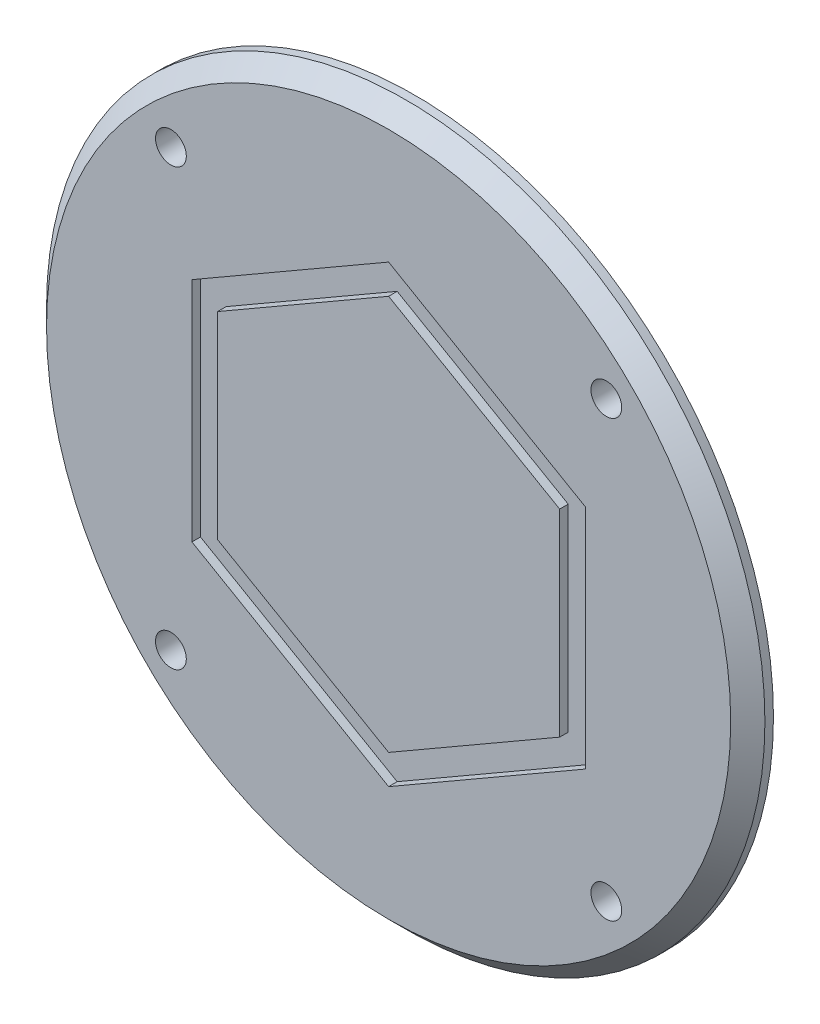
ISO-10303-21;
HEADER;
FILE_DESCRIPTION(('STEP AP214'),'2;1');
FILE_NAME('part.step','',(''),(''),'','','');
FILE_SCHEMA(('AUTOMOTIVE_DESIGN { 1 0 10303 214 1 1 1 1 }'));
ENDSEC;
DATA;
#1=APPLICATION_CONTEXT('core data for automotive mechanical design processes');
#2=APPLICATION_PROTOCOL_DEFINITION('international standard','automotive_design',2000,#1);
#3=PRODUCT_CONTEXT('',#1,'mechanical');
#4=PRODUCT('Part','Part','',(#3));
#5=PRODUCT_RELATED_PRODUCT_CATEGORY('part','',(#4));
#6=PRODUCT_DEFINITION_FORMATION('','',#4);
#7=PRODUCT_DEFINITION_CONTEXT('part definition',#1,'design');
#8=PRODUCT_DEFINITION('design','',#6,#7);
#9=PRODUCT_DEFINITION_SHAPE('','',#8);
#10=(LENGTH_UNIT() NAMED_UNIT(*) SI_UNIT(.MILLI.,.METRE.));
#11=(NAMED_UNIT(*) PLANE_ANGLE_UNIT() SI_UNIT($,.RADIAN.));
#12=(NAMED_UNIT(*) SI_UNIT($,.STERADIAN.) SOLID_ANGLE_UNIT());
#13=UNCERTAINTY_MEASURE_WITH_UNIT(LENGTH_MEASURE(1.E-05),#10,'distance_accuracy_value','');
#14=(GEOMETRIC_REPRESENTATION_CONTEXT(3) GLOBAL_UNCERTAINTY_ASSIGNED_CONTEXT((#13)) GLOBAL_UNIT_ASSIGNED_CONTEXT((#10,
#11,#12)) REPRESENTATION_CONTEXT('',''));
#15=CARTESIAN_POINT('',(0.,0.,0.));
#16=DIRECTION('',(0.,0.,1.));
#17=DIRECTION('',(1.,0.,0.));
#18=AXIS2_PLACEMENT_3D('',#15,#16,#17);
#19=CARTESIAN_POINT('',(0.,0.,116.95));
#20=DIRECTION('',(0.,0.,-1.));
#21=DIRECTION('',(-1.,0.,0.));
#22=AXIS2_PLACEMENT_3D('',#19,#20,#21);
#23=CYLINDRICAL_SURFACE('',#22,42.);
#24=CARTESIAN_POINT('',(0.,0.,114.95));
#25=DIRECTION('',(0.,0.,1.));
#26=DIRECTION('',(1.,0.,0.));
#27=AXIS2_PLACEMENT_3D('',#24,#25,#26);
#28=CIRCLE('',#27,42.);
#29=CARTESIAN_POINT('',(42.,0.,114.95));
#30=VERTEX_POINT('',#29);
#31=EDGE_CURVE('E11',#30,#30,#28,.F.);
#32=ORIENTED_EDGE('',*,*,#31,.T.);
#33=EDGE_LOOP('',(#32));
#34=FACE_BOUND('',#33,.T.);
#35=CARTESIAN_POINT('',(0.,0.,113.95));
#36=DIRECTION('',(0.,0.,1.));
#37=DIRECTION('',(1.,0.,0.));
#38=AXIS2_PLACEMENT_3D('',#35,#36,#37);
#39=CIRCLE('',#38,42.);
#40=CARTESIAN_POINT('',(42.,0.,113.95));
#41=VERTEX_POINT('',#40);
#42=EDGE_CURVE('E256',#41,#41,#39,.T.);
#43=ORIENTED_EDGE('',*,*,#42,.T.);
#44=EDGE_LOOP('',(#43));
#45=FACE_BOUND('',#44,.T.);
#46=ADVANCED_FACE('F38',(#34,#45),#23,.T.);
#47=CARTESIAN_POINT('',(0.,0.,116.95));
#48=DIRECTION('',(0.,0.,1.));
#49=DIRECTION('',(1.,0.,0.));
#50=AXIS2_PLACEMENT_3D('',#47,#48,#49);
#51=PLANE('',#50);
#52=DIRECTION('',(-0.866025403784439,0.5,0.));
#53=VECTOR('',#52,1.);
#54=CARTESIAN_POINT('',(23.,13.2790561913614,116.95));
#55=LINE('',#54,#53);
#56=CARTESIAN_POINT('',(23.,13.2790561913614,116.95));
#57=VERTEX_POINT('',#56);
#58=CARTESIAN_POINT('',(0.,26.5581123827228,116.95));
#59=VERTEX_POINT('',#58);
#60=EDGE_CURVE('E54',#57,#59,#55,.T.);
#61=ORIENTED_EDGE('',*,*,#60,.F.);
#62=DIRECTION('',(0.,1.,0.));
#63=VECTOR('',#62,1.);
#64=CARTESIAN_POINT('',(23.,-13.2790561913614,116.95));
#65=LINE('',#64,#63);
#66=CARTESIAN_POINT('',(23.,-13.2790561913614,116.95));
#67=VERTEX_POINT('',#66);
#68=EDGE_CURVE('E190',#67,#57,#65,.T.);
#69=ORIENTED_EDGE('',*,*,#68,.F.);
#70=DIRECTION('',(0.866025403784439,0.5,0.));
#71=VECTOR('',#70,1.);
#72=CARTESIAN_POINT('',(0.,-26.5581123827228,116.95));
#73=LINE('',#72,#71);
#74=CARTESIAN_POINT('',(0.,-26.5581123827228,116.95));
#75=VERTEX_POINT('',#74);
#76=EDGE_CURVE('E216',#75,#67,#73,.T.);
#77=ORIENTED_EDGE('',*,*,#76,.F.);
#78=DIRECTION('',(0.866025403784439,-0.5,0.));
#79=VECTOR('',#78,1.);
#80=CARTESIAN_POINT('',(-23.,-13.2790561913614,116.95));
#81=LINE('',#80,#79);
#82=CARTESIAN_POINT('',(-23.,-13.2790561913614,116.95));
#83=VERTEX_POINT('',#82);
#84=EDGE_CURVE('E213',#83,#75,#81,.T.);
#85=ORIENTED_EDGE('',*,*,#84,.F.);
#86=DIRECTION('',(0.,-1.,0.));
#87=VECTOR('',#86,1.);
#88=CARTESIAN_POINT('',(-23.,13.2790561913614,116.95));
#89=LINE('',#88,#87);
#90=CARTESIAN_POINT('',(-23.,13.2790561913614,116.95));
#91=VERTEX_POINT('',#90);
#92=EDGE_CURVE('E210',#91,#83,#89,.T.);
#93=ORIENTED_EDGE('',*,*,#92,.F.);
#94=DIRECTION('',(-0.866025403784439,-0.5,0.));
#95=VECTOR('',#94,1.);
#96=CARTESIAN_POINT('',(0.,26.5581123827228,116.95));
#97=LINE('',#96,#95);
#98=EDGE_CURVE('E207',#59,#91,#97,.T.);
#99=ORIENTED_EDGE('',*,*,#98,.F.);
#100=EDGE_LOOP('',(#61,#69,#77,#85,#93,#99));
#101=FACE_BOUND('',#100,.T.);
#102=CARTESIAN_POINT('',(0.,0.,116.95));
#103=DIRECTION('',(0.,0.,1.));
#104=DIRECTION('',(1.,0.,0.));
#105=AXIS2_PLACEMENT_3D('',#102,#103,#104);
#106=CIRCLE('',#105,40.);
#107=CARTESIAN_POINT('',(40.,0.,116.95));
#108=VERTEX_POINT('',#107);
#109=EDGE_CURVE('E47',#108,#108,#106,.T.);
#110=ORIENTED_EDGE('',*,*,#109,.T.);
#111=EDGE_LOOP('',(#110));
#112=FACE_BOUND('',#111,.T.);
#113=CARTESIAN_POINT('',(-25.4558441227155,25.4558441227159,116.95));
#114=DIRECTION('',(0.,0.,1.));
#115=DIRECTION('',(0.,-1.,0.));
#116=AXIS2_PLACEMENT_3D('',#113,#114,#115);
#117=CIRCLE('',#116,1.8);
#118=CARTESIAN_POINT('',(-25.4558441227155,23.6558441227159,116.95));
#119=VERTEX_POINT('',#118);
#120=EDGE_CURVE('E236',#119,#119,#117,.T.);
#121=ORIENTED_EDGE('',*,*,#120,.F.);
#122=EDGE_LOOP('',(#121));
#123=FACE_BOUND('',#122,.T.);
#124=CARTESIAN_POINT('',(25.4558441227158,25.4558441227156,116.95));
#125=DIRECTION('',(0.,0.,1.));
#126=DIRECTION('',(-1.,0.,0.));
#127=AXIS2_PLACEMENT_3D('',#124,#125,#126);
#128=CIRCLE('',#127,1.8);
#129=CARTESIAN_POINT('',(23.6558441227158,25.4558441227156,116.95));
#130=VERTEX_POINT('',#129);
#131=EDGE_CURVE('E237',#130,#130,#128,.T.);
#132=ORIENTED_EDGE('',*,*,#131,.F.);
#133=EDGE_LOOP('',(#132));
#134=FACE_BOUND('',#133,.T.);
#135=CARTESIAN_POINT('',(25.4558441227153,-25.4558441227161,116.95));
#136=DIRECTION('',(0.,0.,1.));
#137=DIRECTION('',(0.,1.,0.));
#138=AXIS2_PLACEMENT_3D('',#135,#136,#137);
#139=CIRCLE('',#138,1.8);
#140=CARTESIAN_POINT('',(25.4558441227153,-23.6558441227161,116.95));
#141=VERTEX_POINT('',#140);
#142=EDGE_CURVE('E244',#141,#141,#139,.T.);
#143=ORIENTED_EDGE('',*,*,#142,.F.);
#144=EDGE_LOOP('',(#143));
#145=FACE_BOUND('',#144,.T.);
#146=CARTESIAN_POINT('',(-25.4558441227158,-25.4558441227156,116.95));
#147=DIRECTION('',(0.,0.,1.));
#148=DIRECTION('',(1.,0.,0.));
#149=AXIS2_PLACEMENT_3D('',#146,#147,#148);
#150=CIRCLE('',#149,1.8);
#151=CARTESIAN_POINT('',(-23.6558441227158,-25.4558441227156,116.95));
#152=VERTEX_POINT('',#151);
#153=EDGE_CURVE('E240',#152,#152,#150,.T.);
#154=ORIENTED_EDGE('',*,*,#153,.F.);
#155=EDGE_LOOP('',(#154));
#156=FACE_BOUND('',#155,.T.);
#157=ADVANCED_FACE('F261',(#101,#112,#123,#134,#145,#156),#51,.T.);
#158=CARTESIAN_POINT('',(0.,0.,113.95));
#159=DIRECTION('',(0.,0.,1.));
#160=DIRECTION('',(1.,0.,0.));
#161=AXIS2_PLACEMENT_3D('',#158,#159,#160);
#162=PLANE('',#161);
#163=CARTESIAN_POINT('',(-25.4558441227155,25.4558441227159,113.95));
#164=DIRECTION('',(0.,0.,1.));
#165=DIRECTION('',(0.,-1.,0.));
#166=AXIS2_PLACEMENT_3D('',#163,#164,#165);
#167=CIRCLE('',#166,1.79999999999999);
#168=CARTESIAN_POINT('',(-25.4558441227155,23.6558441227159,113.95));
#169=VERTEX_POINT('',#168);
#170=EDGE_CURVE('E233',#169,#169,#167,.T.);
#171=ORIENTED_EDGE('',*,*,#170,.T.);
#172=EDGE_LOOP('',(#171));
#173=FACE_BOUND('',#172,.T.);
#174=CARTESIAN_POINT('',(25.4558441227158,25.4558441227156,113.95));
#175=DIRECTION('',(0.,0.,1.));
#176=DIRECTION('',(-1.,0.,0.));
#177=AXIS2_PLACEMENT_3D('',#174,#175,#176);
#178=CIRCLE('',#177,1.79999999999999);
#179=CARTESIAN_POINT('',(23.6558441227159,25.4558441227156,113.95));
#180=VERTEX_POINT('',#179);
#181=EDGE_CURVE('E241',#180,#180,#178,.T.);
#182=ORIENTED_EDGE('',*,*,#181,.T.);
#183=EDGE_LOOP('',(#182));
#184=FACE_BOUND('',#183,.T.);
#185=CARTESIAN_POINT('',(25.4558441227153,-25.4558441227161,113.95));
#186=DIRECTION('',(0.,0.,1.));
#187=DIRECTION('',(0.,1.,0.));
#188=AXIS2_PLACEMENT_3D('',#185,#186,#187);
#189=CIRCLE('',#188,1.79999999999999);
#190=CARTESIAN_POINT('',(25.4558441227153,-23.6558441227161,113.95));
#191=VERTEX_POINT('',#190);
#192=EDGE_CURVE('E223',#191,#191,#189,.T.);
#193=ORIENTED_EDGE('',*,*,#192,.T.);
#194=EDGE_LOOP('',(#193));
#195=FACE_BOUND('',#194,.T.);
#196=CARTESIAN_POINT('',(-25.4558441227158,-25.4558441227156,113.95));
#197=DIRECTION('',(0.,0.,1.));
#198=DIRECTION('',(1.,0.,0.));
#199=AXIS2_PLACEMENT_3D('',#196,#197,#198);
#200=CIRCLE('',#199,1.79999999999999);
#201=CARTESIAN_POINT('',(-23.6558441227159,-25.4558441227156,113.95));
#202=VERTEX_POINT('',#201);
#203=EDGE_CURVE('E253',#202,#202,#200,.T.);
#204=ORIENTED_EDGE('',*,*,#203,.T.);
#205=EDGE_LOOP('',(#204));
#206=FACE_BOUND('',#205,.T.);
#207=ORIENTED_EDGE('',*,*,#42,.F.);
#208=EDGE_LOOP('',(#207));
#209=FACE_BOUND('',#208,.T.);
#210=ADVANCED_FACE('F283',(#173,#184,#195,#206,#209),#162,.F.);
#211=CARTESIAN_POINT('',(-25.4558441227158,-25.4558441227156,116.95));
#212=DIRECTION('',(0.,0.,1.));
#213=DIRECTION('',(1.,0.,0.));
#214=AXIS2_PLACEMENT_3D('',#211,#212,#213);
#215=CYLINDRICAL_SURFACE('',#214,1.79999999999999);
#216=ORIENTED_EDGE('',*,*,#203,.F.);
#217=EDGE_LOOP('',(#216));
#218=FACE_BOUND('',#217,.T.);
#219=ORIENTED_EDGE('',*,*,#153,.T.);
#220=EDGE_LOOP('',(#219));
#221=FACE_BOUND('',#220,.T.);
#222=ADVANCED_FACE('F290',(#218,#221),#215,.F.);
#223=CARTESIAN_POINT('',(25.4558441227153,-25.4558441227161,116.95));
#224=DIRECTION('',(0.,0.,1.));
#225=DIRECTION('',(0.,1.,0.));
#226=AXIS2_PLACEMENT_3D('',#223,#224,#225);
#227=CYLINDRICAL_SURFACE('',#226,1.79999999999999);
#228=ORIENTED_EDGE('',*,*,#192,.F.);
#229=EDGE_LOOP('',(#228));
#230=FACE_BOUND('',#229,.T.);
#231=ORIENTED_EDGE('',*,*,#142,.T.);
#232=EDGE_LOOP('',(#231));
#233=FACE_BOUND('',#232,.T.);
#234=ADVANCED_FACE('F295',(#230,#233),#227,.F.);
#235=CARTESIAN_POINT('',(25.4558441227158,25.4558441227156,116.95));
#236=DIRECTION('',(0.,0.,1.));
#237=DIRECTION('',(-1.,0.,0.));
#238=AXIS2_PLACEMENT_3D('',#235,#236,#237);
#239=CYLINDRICAL_SURFACE('',#238,1.79999999999999);
#240=ORIENTED_EDGE('',*,*,#181,.F.);
#241=EDGE_LOOP('',(#240));
#242=FACE_BOUND('',#241,.T.);
#243=ORIENTED_EDGE('',*,*,#131,.T.);
#244=EDGE_LOOP('',(#243));
#245=FACE_BOUND('',#244,.T.);
#246=ADVANCED_FACE('F274',(#242,#245),#239,.F.);
#247=CARTESIAN_POINT('',(-25.4558441227155,25.4558441227159,116.95));
#248=DIRECTION('',(0.,0.,1.));
#249=DIRECTION('',(0.,-1.,0.));
#250=AXIS2_PLACEMENT_3D('',#247,#248,#249);
#251=CYLINDRICAL_SURFACE('',#250,1.79999999999999);
#252=ORIENTED_EDGE('',*,*,#170,.F.);
#253=EDGE_LOOP('',(#252));
#254=FACE_BOUND('',#253,.T.);
#255=ORIENTED_EDGE('',*,*,#120,.T.);
#256=EDGE_LOOP('',(#255));
#257=FACE_BOUND('',#256,.T.);
#258=ADVANCED_FACE('F266',(#254,#257),#251,.F.);
#259=CARTESIAN_POINT('',(0.,0.,116.95));
#260=DIRECTION('',(0.,0.,-1.));
#261=DIRECTION('',(-1.,0.,0.));
#262=AXIS2_PLACEMENT_3D('',#259,#260,#261);
#263=CONICAL_SURFACE('',#262,40.,0.785398163397453);
#264=ORIENTED_EDGE('',*,*,#31,.F.);
#265=EDGE_LOOP('',(#264));
#266=FACE_BOUND('',#265,.T.);
#267=ORIENTED_EDGE('',*,*,#109,.F.);
#268=EDGE_LOOP('',(#267));
#269=FACE_BOUND('',#268,.T.);
#270=ADVANCED_FACE('F41',(#266,#269),#263,.T.);
#271=CARTESIAN_POINT('',(23.,13.2790561913614,115.95));
#272=DIRECTION('',(0.5,0.866025403784439,0.));
#273=DIRECTION('',(-0.866025403784439,0.5,0.));
#274=AXIS2_PLACEMENT_3D('',#271,#272,#273);
#275=PLANE('',#274);
#276=ORIENTED_EDGE('',*,*,#60,.T.);
#277=DIRECTION('',(0.,0.,1.));
#278=VECTOR('',#277,1.);
#279=CARTESIAN_POINT('',(0.,26.5581123827228,115.95));
#280=LINE('',#279,#278);
#281=CARTESIAN_POINT('',(0.,26.5581123827228,115.95));
#282=VERTEX_POINT('',#281);
#283=EDGE_CURVE('E205',#282,#59,#280,.T.);
#284=ORIENTED_EDGE('',*,*,#283,.F.);
#285=DIRECTION('',(-0.866025403784439,0.5,0.));
#286=VECTOR('',#285,1.);
#287=CARTESIAN_POINT('',(23.,13.2790561913614,115.95));
#288=LINE('',#287,#286);
#289=CARTESIAN_POINT('',(23.,13.2790561913614,115.95));
#290=VERTEX_POINT('',#289);
#291=EDGE_CURVE('E186',#290,#282,#288,.T.);
#292=ORIENTED_EDGE('',*,*,#291,.F.);
#293=DIRECTION('',(0.,0.,1.));
#294=VECTOR('',#293,1.);
#295=CARTESIAN_POINT('',(23.,13.2790561913614,115.95));
#296=LINE('',#295,#294);
#297=EDGE_CURVE('E221',#290,#57,#296,.T.);
#298=ORIENTED_EDGE('',*,*,#297,.T.);
#299=EDGE_LOOP('',(#276,#284,#292,#298));
#300=FACE_BOUND('',#299,.T.);
#301=ADVANCED_FACE('F265',(#300),#275,.F.);
#302=CARTESIAN_POINT('',(23.,-13.2790561913614,115.95));
#303=DIRECTION('',(1.,0.,0.));
#304=DIRECTION('',(0.,1.,0.));
#305=AXIS2_PLACEMENT_3D('',#302,#303,#304);
#306=PLANE('',#305);
#307=ORIENTED_EDGE('',*,*,#68,.T.);
#308=ORIENTED_EDGE('',*,*,#297,.F.);
#309=DIRECTION('',(0.,1.,0.));
#310=VECTOR('',#309,1.);
#311=CARTESIAN_POINT('',(23.,-13.2790561913614,115.95));
#312=LINE('',#311,#310);
#313=CARTESIAN_POINT('',(23.,-13.2790561913614,115.95));
#314=VERTEX_POINT('',#313);
#315=EDGE_CURVE('E202',#314,#290,#312,.T.);
#316=ORIENTED_EDGE('',*,*,#315,.F.);
#317=DIRECTION('',(0.,0.,1.));
#318=VECTOR('',#317,1.);
#319=CARTESIAN_POINT('',(23.,-13.2790561913614,115.95));
#320=LINE('',#319,#318);
#321=EDGE_CURVE('E224',#314,#67,#320,.T.);
#322=ORIENTED_EDGE('',*,*,#321,.T.);
#323=EDGE_LOOP('',(#307,#308,#316,#322));
#324=FACE_BOUND('',#323,.T.);
#325=ADVANCED_FACE('F272',(#324),#306,.F.);
#326=CARTESIAN_POINT('',(0.,-26.5581123827228,115.95));
#327=DIRECTION('',(0.5,-0.866025403784439,0.));
#328=DIRECTION('',(0.866025403784439,0.5,0.));
#329=AXIS2_PLACEMENT_3D('',#326,#327,#328);
#330=PLANE('',#329);
#331=ORIENTED_EDGE('',*,*,#76,.T.);
#332=ORIENTED_EDGE('',*,*,#321,.F.);
#333=DIRECTION('',(0.866025403784439,0.5,0.));
#334=VECTOR('',#333,1.);
#335=CARTESIAN_POINT('',(0.,-26.5581123827228,115.95));
#336=LINE('',#335,#334);
#337=CARTESIAN_POINT('',(0.,-26.5581123827228,115.95));
#338=VERTEX_POINT('',#337);
#339=EDGE_CURVE('E199',#338,#314,#336,.T.);
#340=ORIENTED_EDGE('',*,*,#339,.F.);
#341=DIRECTION('',(0.,0.,1.));
#342=VECTOR('',#341,1.);
#343=CARTESIAN_POINT('',(0.,-26.5581123827228,115.95));
#344=LINE('',#343,#342);
#345=EDGE_CURVE('E226',#338,#75,#344,.T.);
#346=ORIENTED_EDGE('',*,*,#345,.T.);
#347=EDGE_LOOP('',(#331,#332,#340,#346));
#348=FACE_BOUND('',#347,.T.);
#349=ADVANCED_FACE('F314',(#348),#330,.F.);
#350=CARTESIAN_POINT('',(-23.,-13.2790561913614,115.95));
#351=DIRECTION('',(-0.5,-0.866025403784439,0.));
#352=DIRECTION('',(0.866025403784439,-0.5,0.));
#353=AXIS2_PLACEMENT_3D('',#350,#351,#352);
#354=PLANE('',#353);
#355=ORIENTED_EDGE('',*,*,#84,.T.);
#356=ORIENTED_EDGE('',*,*,#345,.F.);
#357=DIRECTION('',(0.866025403784439,-0.5,0.));
#358=VECTOR('',#357,1.);
#359=CARTESIAN_POINT('',(-23.,-13.2790561913614,115.95));
#360=LINE('',#359,#358);
#361=CARTESIAN_POINT('',(-23.,-13.2790561913614,115.95));
#362=VERTEX_POINT('',#361);
#363=EDGE_CURVE('E196',#362,#338,#360,.T.);
#364=ORIENTED_EDGE('',*,*,#363,.F.);
#365=DIRECTION('',(0.,0.,1.));
#366=VECTOR('',#365,1.);
#367=CARTESIAN_POINT('',(-23.,-13.2790561913614,115.95));
#368=LINE('',#367,#366);
#369=EDGE_CURVE('E228',#362,#83,#368,.T.);
#370=ORIENTED_EDGE('',*,*,#369,.T.);
#371=EDGE_LOOP('',(#355,#356,#364,#370));
#372=FACE_BOUND('',#371,.T.);
#373=ADVANCED_FACE('F310',(#372),#354,.F.);
#374=CARTESIAN_POINT('',(-23.,13.2790561913614,115.95));
#375=DIRECTION('',(-1.,0.,0.));
#376=DIRECTION('',(0.,-1.,0.));
#377=AXIS2_PLACEMENT_3D('',#374,#375,#376);
#378=PLANE('',#377);
#379=ORIENTED_EDGE('',*,*,#92,.T.);
#380=ORIENTED_EDGE('',*,*,#369,.F.);
#381=DIRECTION('',(0.,-1.,0.));
#382=VECTOR('',#381,1.);
#383=CARTESIAN_POINT('',(-23.,13.2790561913614,115.95));
#384=LINE('',#383,#382);
#385=CARTESIAN_POINT('',(-23.,13.2790561913614,115.95));
#386=VERTEX_POINT('',#385);
#387=EDGE_CURVE('E193',#386,#362,#384,.T.);
#388=ORIENTED_EDGE('',*,*,#387,.F.);
#389=DIRECTION('',(0.,0.,1.));
#390=VECTOR('',#389,1.);
#391=CARTESIAN_POINT('',(-23.,13.2790561913614,115.95));
#392=LINE('',#391,#390);
#393=EDGE_CURVE('E230',#386,#91,#392,.T.);
#394=ORIENTED_EDGE('',*,*,#393,.T.);
#395=EDGE_LOOP('',(#379,#380,#388,#394));
#396=FACE_BOUND('',#395,.T.);
#397=ADVANCED_FACE('F306',(#396),#378,.F.);
#398=CARTESIAN_POINT('',(0.,26.5581123827228,115.95));
#399=DIRECTION('',(-0.5,0.866025403784439,0.));
#400=DIRECTION('',(-0.866025403784439,-0.5,0.));
#401=AXIS2_PLACEMENT_3D('',#398,#399,#400);
#402=PLANE('',#401);
#403=ORIENTED_EDGE('',*,*,#98,.T.);
#404=ORIENTED_EDGE('',*,*,#393,.F.);
#405=DIRECTION('',(-0.866025403784439,-0.5,0.));
#406=VECTOR('',#405,1.);
#407=CARTESIAN_POINT('',(0.,26.5581123827228,115.95));
#408=LINE('',#407,#406);
#409=EDGE_CURVE('E189',#282,#386,#408,.T.);
#410=ORIENTED_EDGE('',*,*,#409,.F.);
#411=ORIENTED_EDGE('',*,*,#283,.T.);
#412=EDGE_LOOP('',(#403,#404,#410,#411));
#413=FACE_BOUND('',#412,.T.);
#414=ADVANCED_FACE('F303',(#413),#402,.F.);
#415=CARTESIAN_POINT('',(0.,0.,115.95));
#416=DIRECTION('',(0.,0.,1.));
#417=DIRECTION('',(1.,0.,0.));
#418=AXIS2_PLACEMENT_3D('',#415,#416,#417);
#419=PLANE('',#418);
#420=DIRECTION('',(0.,1.,0.));
#421=VECTOR('',#420,1.);
#422=CARTESIAN_POINT('',(20.,-11.5470053837925,115.95));
#423=LINE('',#422,#421);
#424=CARTESIAN_POINT('',(20.,-11.5470053837925,115.95));
#425=VERTEX_POINT('',#424);
#426=CARTESIAN_POINT('',(20.,11.5470053837925,115.95));
#427=VERTEX_POINT('',#426);
#428=EDGE_CURVE('E140',#425,#427,#423,.T.);
#429=ORIENTED_EDGE('',*,*,#428,.F.);
#430=DIRECTION('',(0.866025403784439,0.5,0.));
#431=VECTOR('',#430,1.);
#432=CARTESIAN_POINT('',(0.,-23.094010767585,115.95));
#433=LINE('',#432,#431);
#434=CARTESIAN_POINT('',(0.,-23.094010767585,115.95));
#435=VERTEX_POINT('',#434);
#436=EDGE_CURVE('E165',#435,#425,#433,.T.);
#437=ORIENTED_EDGE('',*,*,#436,.F.);
#438=DIRECTION('',(0.866025403784439,-0.5,0.));
#439=VECTOR('',#438,1.);
#440=CARTESIAN_POINT('',(-20.,-11.5470053837925,115.95));
#441=LINE('',#440,#439);
#442=CARTESIAN_POINT('',(-20.,-11.5470053837925,115.95));
#443=VERTEX_POINT('',#442);
#444=EDGE_CURVE('E162',#443,#435,#441,.T.);
#445=ORIENTED_EDGE('',*,*,#444,.F.);
#446=DIRECTION('',(0.,-1.,0.));
#447=VECTOR('',#446,1.);
#448=CARTESIAN_POINT('',(-20.,11.5470053837925,115.95));
#449=LINE('',#448,#447);
#450=CARTESIAN_POINT('',(-20.,11.5470053837925,115.95));
#451=VERTEX_POINT('',#450);
#452=EDGE_CURVE('E151',#451,#443,#449,.T.);
#453=ORIENTED_EDGE('',*,*,#452,.F.);
#454=DIRECTION('',(-0.866025403784439,-0.5,0.));
#455=VECTOR('',#454,1.);
#456=CARTESIAN_POINT('',(0.,23.094010767585,115.95));
#457=LINE('',#456,#455);
#458=CARTESIAN_POINT('',(0.,23.094010767585,115.95));
#459=VERTEX_POINT('',#458);
#460=EDGE_CURVE('E132',#459,#451,#457,.T.);
#461=ORIENTED_EDGE('',*,*,#460,.F.);
#462=DIRECTION('',(-0.866025403784439,0.5,0.));
#463=VECTOR('',#462,1.);
#464=CARTESIAN_POINT('',(20.,11.5470053837925,115.95));
#465=LINE('',#464,#463);
#466=EDGE_CURVE('E147',#427,#459,#465,.T.);
#467=ORIENTED_EDGE('',*,*,#466,.F.);
#468=EDGE_LOOP('',(#429,#437,#445,#453,#461,#467));
#469=FACE_BOUND('',#468,.T.);
#470=ORIENTED_EDGE('',*,*,#291,.T.);
#471=ORIENTED_EDGE('',*,*,#409,.T.);
#472=ORIENTED_EDGE('',*,*,#387,.T.);
#473=ORIENTED_EDGE('',*,*,#363,.T.);
#474=ORIENTED_EDGE('',*,*,#339,.T.);
#475=ORIENTED_EDGE('',*,*,#315,.T.);
#476=EDGE_LOOP('',(#470,#471,#472,#473,#474,#475));
#477=FACE_BOUND('',#476,.T.);
#478=ADVANCED_FACE('F145',(#469,#477),#419,.T.);
#479=CARTESIAN_POINT('',(20.,11.5470053837925,115.95));
#480=DIRECTION('',(0.5,0.866025403784439,0.));
#481=DIRECTION('',(-0.866025403784439,0.5,0.));
#482=AXIS2_PLACEMENT_3D('',#479,#480,#481);
#483=PLANE('',#482);
#484=DIRECTION('',(-0.866025403784439,0.5,0.));
#485=VECTOR('',#484,1.);
#486=CARTESIAN_POINT('',(20.,11.5470053837925,116.95));
#487=LINE('',#486,#485);
#488=CARTESIAN_POINT('',(20.,11.5470053837925,116.95));
#489=VERTEX_POINT('',#488);
#490=CARTESIAN_POINT('',(0.,23.094010767585,116.95));
#491=VERTEX_POINT('',#490);
#492=EDGE_CURVE('E169',#489,#491,#487,.T.);
#493=ORIENTED_EDGE('',*,*,#492,.F.);
#494=DIRECTION('',(0.,0.,1.));
#495=VECTOR('',#494,1.);
#496=CARTESIAN_POINT('',(20.,11.5470053837925,115.95));
#497=LINE('',#496,#495);
#498=EDGE_CURVE('E154',#427,#489,#497,.T.);
#499=ORIENTED_EDGE('',*,*,#498,.F.);
#500=ORIENTED_EDGE('',*,*,#466,.T.);
#501=DIRECTION('',(0.,0.,1.));
#502=VECTOR('',#501,1.);
#503=CARTESIAN_POINT('',(0.,23.094010767585,115.95));
#504=LINE('',#503,#502);
#505=EDGE_CURVE('E129',#459,#491,#504,.T.);
#506=ORIENTED_EDGE('',*,*,#505,.T.);
#507=EDGE_LOOP('',(#493,#499,#500,#506));
#508=FACE_BOUND('',#507,.T.);
#509=ADVANCED_FACE('F153',(#508),#483,.T.);
#510=CARTESIAN_POINT('',(20.,-11.5470053837925,115.95));
#511=DIRECTION('',(1.,0.,0.));
#512=DIRECTION('',(0.,1.,0.));
#513=AXIS2_PLACEMENT_3D('',#510,#511,#512);
#514=PLANE('',#513);
#515=DIRECTION('',(0.,1.,0.));
#516=VECTOR('',#515,1.);
#517=CARTESIAN_POINT('',(20.,-11.5470053837925,116.95));
#518=LINE('',#517,#516);
#519=CARTESIAN_POINT('',(20.,-11.5470053837925,116.95));
#520=VERTEX_POINT('',#519);
#521=EDGE_CURVE('E155',#520,#489,#518,.T.);
#522=ORIENTED_EDGE('',*,*,#521,.F.);
#523=DIRECTION('',(0.,0.,1.));
#524=VECTOR('',#523,1.);
#525=CARTESIAN_POINT('',(20.,-11.5470053837925,115.95));
#526=LINE('',#525,#524);
#527=EDGE_CURVE('E179',#425,#520,#526,.T.);
#528=ORIENTED_EDGE('',*,*,#527,.F.);
#529=ORIENTED_EDGE('',*,*,#428,.T.);
#530=ORIENTED_EDGE('',*,*,#498,.T.);
#531=EDGE_LOOP('',(#522,#528,#529,#530));
#532=FACE_BOUND('',#531,.T.);
#533=ADVANCED_FACE('F326',(#532),#514,.T.);
#534=CARTESIAN_POINT('',(0.,-23.094010767585,115.95));
#535=DIRECTION('',(0.5,-0.866025403784439,0.));
#536=DIRECTION('',(0.866025403784439,0.5,0.));
#537=AXIS2_PLACEMENT_3D('',#534,#535,#536);
#538=PLANE('',#537);
#539=DIRECTION('',(0.866025403784439,0.5,0.));
#540=VECTOR('',#539,1.);
#541=CARTESIAN_POINT('',(0.,-23.094010767585,116.95));
#542=LINE('',#541,#540);
#543=CARTESIAN_POINT('',(0.,-23.094010767585,116.95));
#544=VERTEX_POINT('',#543);
#545=EDGE_CURVE('E158',#544,#520,#542,.T.);
#546=ORIENTED_EDGE('',*,*,#545,.F.);
#547=DIRECTION('',(0.,0.,1.));
#548=VECTOR('',#547,1.);
#549=CARTESIAN_POINT('',(0.,-23.094010767585,115.95));
#550=LINE('',#549,#548);
#551=EDGE_CURVE('E181',#435,#544,#550,.T.);
#552=ORIENTED_EDGE('',*,*,#551,.F.);
#553=ORIENTED_EDGE('',*,*,#436,.T.);
#554=ORIENTED_EDGE('',*,*,#527,.T.);
#555=EDGE_LOOP('',(#546,#552,#553,#554));
#556=FACE_BOUND('',#555,.T.);
#557=ADVANCED_FACE('F335',(#556),#538,.T.);
#558=CARTESIAN_POINT('',(-20.,-11.5470053837925,115.95));
#559=DIRECTION('',(-0.5,-0.866025403784439,0.));
#560=DIRECTION('',(0.866025403784439,-0.5,0.));
#561=AXIS2_PLACEMENT_3D('',#558,#559,#560);
#562=PLANE('',#561);
#563=DIRECTION('',(0.866025403784439,-0.5,0.));
#564=VECTOR('',#563,1.);
#565=CARTESIAN_POINT('',(-20.,-11.5470053837925,116.95));
#566=LINE('',#565,#564);
#567=CARTESIAN_POINT('',(-20.,-11.5470053837925,116.95));
#568=VERTEX_POINT('',#567);
#569=EDGE_CURVE('E173',#568,#544,#566,.T.);
#570=ORIENTED_EDGE('',*,*,#569,.F.);
#571=DIRECTION('',(0.,0.,1.));
#572=VECTOR('',#571,1.);
#573=CARTESIAN_POINT('',(-20.,-11.5470053837925,115.95));
#574=LINE('',#573,#572);
#575=EDGE_CURVE('E183',#443,#568,#574,.T.);
#576=ORIENTED_EDGE('',*,*,#575,.F.);
#577=ORIENTED_EDGE('',*,*,#444,.T.);
#578=ORIENTED_EDGE('',*,*,#551,.T.);
#579=EDGE_LOOP('',(#570,#576,#577,#578));
#580=FACE_BOUND('',#579,.T.);
#581=ADVANCED_FACE('F332',(#580),#562,.T.);
#582=CARTESIAN_POINT('',(-20.,11.5470053837925,115.95));
#583=DIRECTION('',(-1.,0.,0.));
#584=DIRECTION('',(0.,-1.,0.));
#585=AXIS2_PLACEMENT_3D('',#582,#583,#584);
#586=PLANE('',#585);
#587=DIRECTION('',(0.,-1.,0.));
#588=VECTOR('',#587,1.);
#589=CARTESIAN_POINT('',(-20.,11.5470053837925,116.95));
#590=LINE('',#589,#588);
#591=CARTESIAN_POINT('',(-20.,11.5470053837925,116.95));
#592=VERTEX_POINT('',#591);
#593=EDGE_CURVE('E62',#592,#568,#590,.T.);
#594=ORIENTED_EDGE('',*,*,#593,.F.);
#595=DIRECTION('',(0.,0.,1.));
#596=VECTOR('',#595,1.);
#597=CARTESIAN_POINT('',(-20.,11.5470053837925,115.95));
#598=LINE('',#597,#596);
#599=EDGE_CURVE('E139',#451,#592,#598,.T.);
#600=ORIENTED_EDGE('',*,*,#599,.F.);
#601=ORIENTED_EDGE('',*,*,#452,.T.);
#602=ORIENTED_EDGE('',*,*,#575,.T.);
#603=EDGE_LOOP('',(#594,#600,#601,#602));
#604=FACE_BOUND('',#603,.T.);
#605=ADVANCED_FACE('F329',(#604),#586,.T.);
#606=CARTESIAN_POINT('',(0.,23.094010767585,115.95));
#607=DIRECTION('',(-0.5,0.866025403784439,0.));
#608=DIRECTION('',(-0.866025403784439,-0.5,0.));
#609=AXIS2_PLACEMENT_3D('',#606,#607,#608);
#610=PLANE('',#609);
#611=DIRECTION('',(-0.866025403784439,-0.5,0.));
#612=VECTOR('',#611,1.);
#613=CARTESIAN_POINT('',(0.,23.094010767585,116.95));
#614=LINE('',#613,#612);
#615=EDGE_CURVE('E134',#491,#592,#614,.T.);
#616=ORIENTED_EDGE('',*,*,#615,.F.);
#617=ORIENTED_EDGE('',*,*,#505,.F.);
#618=ORIENTED_EDGE('',*,*,#460,.T.);
#619=ORIENTED_EDGE('',*,*,#599,.T.);
#620=EDGE_LOOP('',(#616,#617,#618,#619));
#621=FACE_BOUND('',#620,.T.);
#622=ADVANCED_FACE('F131',(#621),#610,.T.);
#623=ORIENTED_EDGE('',*,*,#521,.T.);
#624=ORIENTED_EDGE('',*,*,#492,.T.);
#625=ORIENTED_EDGE('',*,*,#615,.T.);
#626=ORIENTED_EDGE('',*,*,#593,.T.);
#627=ORIENTED_EDGE('',*,*,#569,.T.);
#628=ORIENTED_EDGE('',*,*,#545,.T.);
#629=EDGE_LOOP('',(#623,#624,#625,#626,#627,#628));
#630=FACE_BOUND('',#629,.T.);
#631=ADVANCED_FACE('F286',(#630),#51,.T.);
#632=CLOSED_SHELL('',(#46,#157,#210,#222,#234,#246,#258,#270,#301,#325,#349,#373,#397,#414,#478,
#509,#533,#557,#581,#605,#622,#631));
#633=MANIFOLD_SOLID_BREP('B2',#632);
#634=ADVANCED_BREP_SHAPE_REPRESENTATION('',(#18,#633),#14);
#635=SHAPE_DEFINITION_REPRESENTATION(#9,#634);
ENDSEC;
END-ISO-10303-21;
